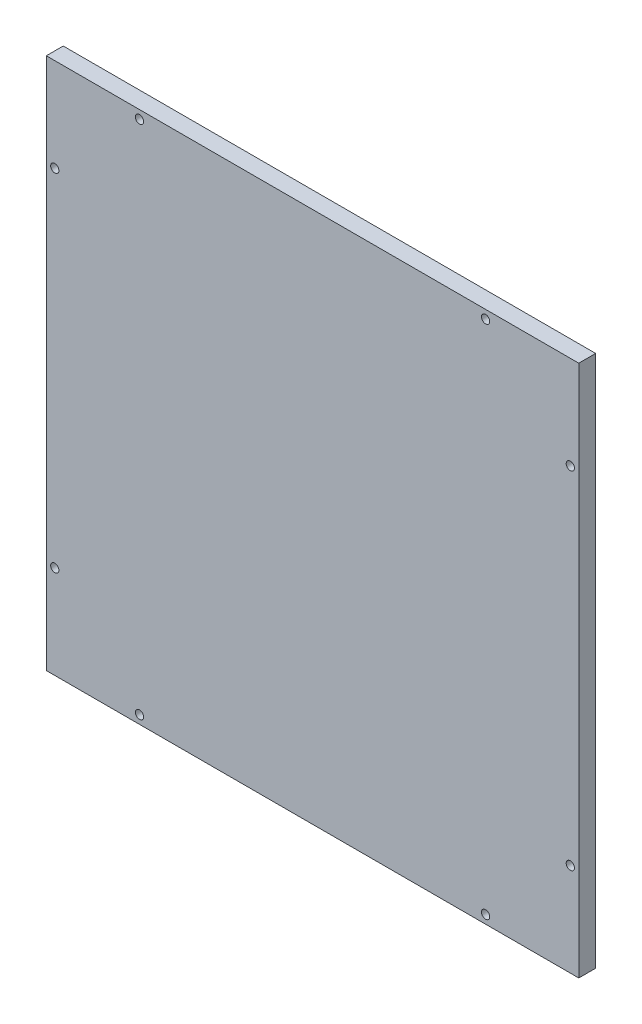
ISO-10303-21;
HEADER;
FILE_DESCRIPTION(('STEP AP214'),'2;1');
FILE_NAME('part.step','',(''),(''),'','','');
FILE_SCHEMA(('AUTOMOTIVE_DESIGN { 1 0 10303 214 1 1 1 1 }'));
ENDSEC;
DATA;
#1=APPLICATION_CONTEXT('core data for automotive mechanical design processes');
#2=APPLICATION_PROTOCOL_DEFINITION('international standard','automotive_design',2000,#1);
#3=PRODUCT_CONTEXT('',#1,'mechanical');
#4=PRODUCT('Part','Part','',(#3));
#5=PRODUCT_RELATED_PRODUCT_CATEGORY('part','',(#4));
#6=PRODUCT_DEFINITION_FORMATION('','',#4);
#7=PRODUCT_DEFINITION_CONTEXT('part definition',#1,'design');
#8=PRODUCT_DEFINITION('design','',#6,#7);
#9=PRODUCT_DEFINITION_SHAPE('','',#8);
#10=(LENGTH_UNIT() NAMED_UNIT(*) SI_UNIT(.MILLI.,.METRE.));
#11=(NAMED_UNIT(*) PLANE_ANGLE_UNIT() SI_UNIT($,.RADIAN.));
#12=(NAMED_UNIT(*) SI_UNIT($,.STERADIAN.) SOLID_ANGLE_UNIT());
#13=UNCERTAINTY_MEASURE_WITH_UNIT(LENGTH_MEASURE(1.E-05),#10,'distance_accuracy_value','');
#14=(GEOMETRIC_REPRESENTATION_CONTEXT(3) GLOBAL_UNCERTAINTY_ASSIGNED_CONTEXT((#13)) GLOBAL_UNIT_ASSIGNED_CONTEXT((#10,
#11,#12)) REPRESENTATION_CONTEXT('',''));
#15=CARTESIAN_POINT('',(0.,0.,0.));
#16=DIRECTION('',(0.,0.,1.));
#17=DIRECTION('',(1.,0.,0.));
#18=AXIS2_PLACEMENT_3D('',#15,#16,#17);
#19=CARTESIAN_POINT('',(100.,-100.,6.35));
#20=DIRECTION('',(-1.,0.,0.));
#21=DIRECTION('',(0.,0.,1.));
#22=AXIS2_PLACEMENT_3D('',#19,#20,#21);
#23=PLANE('',#22);
#24=DIRECTION('',(0.,1.,0.));
#25=VECTOR('',#24,1.);
#26=CARTESIAN_POINT('',(100.,-100.,0.));
#27=LINE('',#26,#25);
#28=CARTESIAN_POINT('',(100.,-100.,0.));
#29=VERTEX_POINT('',#28);
#30=CARTESIAN_POINT('',(100.,100.,0.));
#31=VERTEX_POINT('',#30);
#32=EDGE_CURVE('E101',#29,#31,#27,.T.);
#33=ORIENTED_EDGE('',*,*,#32,.T.);
#34=DIRECTION('',(0.,0.,-1.));
#35=VECTOR('',#34,1.);
#36=CARTESIAN_POINT('',(100.,100.,6.35));
#37=LINE('',#36,#35);
#38=CARTESIAN_POINT('',(100.,100.,6.35));
#39=VERTEX_POINT('',#38);
#40=EDGE_CURVE('E11',#39,#31,#37,.T.);
#41=ORIENTED_EDGE('',*,*,#40,.F.);
#42=DIRECTION('',(0.,1.,0.));
#43=VECTOR('',#42,1.);
#44=CARTESIAN_POINT('',(100.,-100.,6.35));
#45=LINE('',#44,#43);
#46=CARTESIAN_POINT('',(100.,-100.,6.35));
#47=VERTEX_POINT('',#46);
#48=EDGE_CURVE('E89',#47,#39,#45,.T.);
#49=ORIENTED_EDGE('',*,*,#48,.F.);
#50=DIRECTION('',(0.,0.,-1.));
#51=VECTOR('',#50,1.);
#52=CARTESIAN_POINT('',(100.,-100.,6.35));
#53=LINE('',#52,#51);
#54=EDGE_CURVE('E97',#47,#29,#53,.T.);
#55=ORIENTED_EDGE('',*,*,#54,.T.);
#56=EDGE_LOOP('',(#33,#41,#49,#55));
#57=FACE_BOUND('',#56,.T.);
#58=ADVANCED_FACE('F38',(#57),#23,.F.);
#59=CARTESIAN_POINT('',(-100.,100.,6.35));
#60=DIRECTION('',(0.,-1.,0.));
#61=DIRECTION('',(0.,0.,-1.));
#62=AXIS2_PLACEMENT_3D('',#59,#60,#61);
#63=PLANE('',#62);
#64=DIRECTION('',(-1.,0.,0.));
#65=VECTOR('',#64,1.);
#66=CARTESIAN_POINT('',(-100.,100.,0.));
#67=LINE('',#66,#65);
#68=CARTESIAN_POINT('',(-100.,100.,0.));
#69=VERTEX_POINT('',#68);
#70=EDGE_CURVE('E93',#31,#69,#67,.T.);
#71=ORIENTED_EDGE('',*,*,#70,.T.);
#72=DIRECTION('',(0.,0.,-1.));
#73=VECTOR('',#72,1.);
#74=CARTESIAN_POINT('',(-100.,100.,6.35));
#75=LINE('',#74,#73);
#76=CARTESIAN_POINT('',(-100.,100.,6.35));
#77=VERTEX_POINT('',#76);
#78=EDGE_CURVE('E46',#77,#69,#75,.T.);
#79=ORIENTED_EDGE('',*,*,#78,.F.);
#80=DIRECTION('',(-1.,0.,0.));
#81=VECTOR('',#80,1.);
#82=CARTESIAN_POINT('',(-100.,100.,6.35));
#83=LINE('',#82,#81);
#84=EDGE_CURVE('E84',#39,#77,#83,.T.);
#85=ORIENTED_EDGE('',*,*,#84,.F.);
#86=ORIENTED_EDGE('',*,*,#40,.T.);
#87=EDGE_LOOP('',(#71,#79,#85,#86));
#88=FACE_BOUND('',#87,.T.);
#89=ADVANCED_FACE('F92',(#88),#63,.F.);
#90=CARTESIAN_POINT('',(-100.,-100.,6.35));
#91=DIRECTION('',(1.,0.,0.));
#92=DIRECTION('',(0.,0.,-1.));
#93=AXIS2_PLACEMENT_3D('',#90,#91,#92);
#94=PLANE('',#93);
#95=DIRECTION('',(0.,-1.,0.));
#96=VECTOR('',#95,1.);
#97=CARTESIAN_POINT('',(-100.,-100.,0.));
#98=LINE('',#97,#96);
#99=CARTESIAN_POINT('',(-100.,-100.,0.));
#100=VERTEX_POINT('',#99);
#101=EDGE_CURVE('E71',#69,#100,#98,.T.);
#102=ORIENTED_EDGE('',*,*,#101,.T.);
#103=DIRECTION('',(0.,0.,-1.));
#104=VECTOR('',#103,1.);
#105=CARTESIAN_POINT('',(-100.,-100.,6.35));
#106=LINE('',#105,#104);
#107=CARTESIAN_POINT('',(-100.,-100.,6.35));
#108=VERTEX_POINT('',#107);
#109=EDGE_CURVE('E94',#108,#100,#106,.T.);
#110=ORIENTED_EDGE('',*,*,#109,.F.);
#111=DIRECTION('',(0.,-1.,0.));
#112=VECTOR('',#111,1.);
#113=CARTESIAN_POINT('',(-100.,-100.,6.35));
#114=LINE('',#113,#112);
#115=EDGE_CURVE('E87',#77,#108,#114,.T.);
#116=ORIENTED_EDGE('',*,*,#115,.F.);
#117=ORIENTED_EDGE('',*,*,#78,.T.);
#118=EDGE_LOOP('',(#102,#110,#116,#117));
#119=FACE_BOUND('',#118,.T.);
#120=ADVANCED_FACE('F95',(#119),#94,.F.);
#121=CARTESIAN_POINT('',(-100.,-100.,6.35));
#122=DIRECTION('',(0.,1.,0.));
#123=DIRECTION('',(0.,0.,1.));
#124=AXIS2_PLACEMENT_3D('',#121,#122,#123);
#125=PLANE('',#124);
#126=DIRECTION('',(1.,0.,0.));
#127=VECTOR('',#126,1.);
#128=CARTESIAN_POINT('',(-100.,-100.,0.));
#129=LINE('',#128,#127);
#130=EDGE_CURVE('E77',#100,#29,#129,.T.);
#131=ORIENTED_EDGE('',*,*,#130,.T.);
#132=ORIENTED_EDGE('',*,*,#54,.F.);
#133=DIRECTION('',(1.,0.,0.));
#134=VECTOR('',#133,1.);
#135=CARTESIAN_POINT('',(-100.,-100.,6.35));
#136=LINE('',#135,#134);
#137=EDGE_CURVE('E54',#108,#47,#136,.T.);
#138=ORIENTED_EDGE('',*,*,#137,.F.);
#139=ORIENTED_EDGE('',*,*,#109,.T.);
#140=EDGE_LOOP('',(#131,#132,#138,#139));
#141=FACE_BOUND('',#140,.T.);
#142=ADVANCED_FACE('F109',(#141),#125,.F.);
#143=CARTESIAN_POINT('',(0.,0.,6.35));
#144=DIRECTION('',(0.,0.,-1.));
#145=DIRECTION('',(-1.,0.,0.));
#146=AXIS2_PLACEMENT_3D('',#143,#144,#145);
#147=PLANE('',#146);
#148=CARTESIAN_POINT('',(96.825,65.,6.35));
#149=DIRECTION('',(0.,0.,1.));
#150=DIRECTION('',(1.,0.,0.));
#151=AXIS2_PLACEMENT_3D('',#148,#149,#150);
#152=CIRCLE('',#151,1.54999999999999);
#153=CARTESIAN_POINT('',(98.375,65.,6.35));
#154=VERTEX_POINT('',#153);
#155=EDGE_CURVE('E133',#154,#154,#152,.T.);
#156=ORIENTED_EDGE('',*,*,#155,.F.);
#157=EDGE_LOOP('',(#156));
#158=FACE_BOUND('',#157,.T.);
#159=CARTESIAN_POINT('',(-65.,-96.825,6.35));
#160=DIRECTION('',(0.,0.,1.));
#161=DIRECTION('',(-1.,0.,0.));
#162=AXIS2_PLACEMENT_3D('',#159,#160,#161);
#163=CIRCLE('',#162,1.54999999999998);
#164=CARTESIAN_POINT('',(-66.55,-96.825,6.35));
#165=VERTEX_POINT('',#164);
#166=EDGE_CURVE('E140',#165,#165,#163,.T.);
#167=ORIENTED_EDGE('',*,*,#166,.F.);
#168=EDGE_LOOP('',(#167));
#169=FACE_BOUND('',#168,.T.);
#170=CARTESIAN_POINT('',(65.,-96.825,6.35));
#171=DIRECTION('',(0.,0.,1.));
#172=DIRECTION('',(1.,0.,0.));
#173=AXIS2_PLACEMENT_3D('',#170,#171,#172);
#174=CIRCLE('',#173,1.54999999999999);
#175=CARTESIAN_POINT('',(66.55,-96.825,6.35));
#176=VERTEX_POINT('',#175);
#177=EDGE_CURVE('E121',#176,#176,#174,.T.);
#178=ORIENTED_EDGE('',*,*,#177,.F.);
#179=EDGE_LOOP('',(#178));
#180=FACE_BOUND('',#179,.T.);
#181=CARTESIAN_POINT('',(65.,96.825,6.35));
#182=DIRECTION('',(0.,0.,1.));
#183=DIRECTION('',(-1.,0.,0.));
#184=AXIS2_PLACEMENT_3D('',#181,#182,#183);
#185=CIRCLE('',#184,1.54999999999999);
#186=CARTESIAN_POINT('',(63.45,96.825,6.35));
#187=VERTEX_POINT('',#186);
#188=EDGE_CURVE('E128',#187,#187,#185,.T.);
#189=ORIENTED_EDGE('',*,*,#188,.F.);
#190=EDGE_LOOP('',(#189));
#191=FACE_BOUND('',#190,.T.);
#192=CARTESIAN_POINT('',(96.825,-65.,6.35));
#193=DIRECTION('',(0.,0.,1.));
#194=DIRECTION('',(-1.,0.,0.));
#195=AXIS2_PLACEMENT_3D('',#192,#193,#194);
#196=CIRCLE('',#195,1.54999999999999);
#197=CARTESIAN_POINT('',(95.275,-65.,6.35));
#198=VERTEX_POINT('',#197);
#199=EDGE_CURVE('E157',#198,#198,#196,.T.);
#200=ORIENTED_EDGE('',*,*,#199,.F.);
#201=EDGE_LOOP('',(#200));
#202=FACE_BOUND('',#201,.T.);
#203=CARTESIAN_POINT('',(-96.825,-65.,6.35));
#204=DIRECTION('',(0.,0.,1.));
#205=DIRECTION('',(1.,0.,0.));
#206=AXIS2_PLACEMENT_3D('',#203,#204,#205);
#207=CIRCLE('',#206,1.54999999999999);
#208=CARTESIAN_POINT('',(-95.275,-65.,6.35));
#209=VERTEX_POINT('',#208);
#210=EDGE_CURVE('E151',#209,#209,#207,.T.);
#211=ORIENTED_EDGE('',*,*,#210,.F.);
#212=EDGE_LOOP('',(#211));
#213=FACE_BOUND('',#212,.T.);
#214=CARTESIAN_POINT('',(-96.825,65.,6.35));
#215=DIRECTION('',(0.,0.,1.));
#216=DIRECTION('',(-1.,0.,0.));
#217=AXIS2_PLACEMENT_3D('',#214,#215,#216);
#218=CIRCLE('',#217,1.54999999999999);
#219=CARTESIAN_POINT('',(-98.375,65.,6.35));
#220=VERTEX_POINT('',#219);
#221=EDGE_CURVE('E145',#220,#220,#218,.T.);
#222=ORIENTED_EDGE('',*,*,#221,.F.);
#223=EDGE_LOOP('',(#222));
#224=FACE_BOUND('',#223,.T.);
#225=CARTESIAN_POINT('',(-65.,96.825,6.35));
#226=DIRECTION('',(0.,0.,1.));
#227=DIRECTION('',(1.,0.,0.));
#228=AXIS2_PLACEMENT_3D('',#225,#226,#227);
#229=CIRCLE('',#228,1.54999999999999);
#230=CARTESIAN_POINT('',(-63.45,96.825,6.35));
#231=VERTEX_POINT('',#230);
#232=EDGE_CURVE('E115',#231,#231,#229,.T.);
#233=ORIENTED_EDGE('',*,*,#232,.F.);
#234=EDGE_LOOP('',(#233));
#235=FACE_BOUND('',#234,.T.);
#236=ORIENTED_EDGE('',*,*,#48,.T.);
#237=ORIENTED_EDGE('',*,*,#84,.T.);
#238=ORIENTED_EDGE('',*,*,#115,.T.);
#239=ORIENTED_EDGE('',*,*,#137,.T.);
#240=EDGE_LOOP('',(#236,#237,#238,#239));
#241=FACE_BOUND('',#240,.T.);
#242=ADVANCED_FACE('F85',(#158,#169,#180,#191,#202,#213,#224,#235,#241),#147,.F.);
#243=CARTESIAN_POINT('',(0.,0.,0.));
#244=DIRECTION('',(0.,0.,-1.));
#245=DIRECTION('',(-1.,0.,0.));
#246=AXIS2_PLACEMENT_3D('',#243,#244,#245);
#247=PLANE('',#246);
#248=CARTESIAN_POINT('',(96.825,65.,0.));
#249=DIRECTION('',(0.,0.,1.));
#250=DIRECTION('',(1.,0.,0.));
#251=AXIS2_PLACEMENT_3D('',#248,#249,#250);
#252=CIRCLE('',#251,1.54999999999999);
#253=CARTESIAN_POINT('',(98.375,65.,0.));
#254=VERTEX_POINT('',#253);
#255=EDGE_CURVE('E136',#254,#254,#252,.T.);
#256=ORIENTED_EDGE('',*,*,#255,.T.);
#257=EDGE_LOOP('',(#256));
#258=FACE_BOUND('',#257,.T.);
#259=CARTESIAN_POINT('',(-65.,-96.825,0.));
#260=DIRECTION('',(0.,0.,1.));
#261=DIRECTION('',(-1.,0.,0.));
#262=AXIS2_PLACEMENT_3D('',#259,#260,#261);
#263=CIRCLE('',#262,1.54999999999998);
#264=CARTESIAN_POINT('',(-66.55,-96.825,0.));
#265=VERTEX_POINT('',#264);
#266=EDGE_CURVE('E125',#265,#265,#263,.T.);
#267=ORIENTED_EDGE('',*,*,#266,.T.);
#268=EDGE_LOOP('',(#267));
#269=FACE_BOUND('',#268,.T.);
#270=CARTESIAN_POINT('',(65.,-96.825,0.));
#271=DIRECTION('',(0.,0.,1.));
#272=DIRECTION('',(1.,0.,0.));
#273=AXIS2_PLACEMENT_3D('',#270,#271,#272);
#274=CIRCLE('',#273,1.54999999999999);
#275=CARTESIAN_POINT('',(66.55,-96.825,0.));
#276=VERTEX_POINT('',#275);
#277=EDGE_CURVE('E124',#276,#276,#274,.T.);
#278=ORIENTED_EDGE('',*,*,#277,.T.);
#279=EDGE_LOOP('',(#278));
#280=FACE_BOUND('',#279,.T.);
#281=CARTESIAN_POINT('',(65.,96.825,0.));
#282=DIRECTION('',(0.,0.,1.));
#283=DIRECTION('',(-1.,0.,0.));
#284=AXIS2_PLACEMENT_3D('',#281,#282,#283);
#285=CIRCLE('',#284,1.54999999999999);
#286=CARTESIAN_POINT('',(63.45,96.825,0.));
#287=VERTEX_POINT('',#286);
#288=EDGE_CURVE('E118',#287,#287,#285,.T.);
#289=ORIENTED_EDGE('',*,*,#288,.T.);
#290=EDGE_LOOP('',(#289));
#291=FACE_BOUND('',#290,.T.);
#292=CARTESIAN_POINT('',(96.825,-65.,0.));
#293=DIRECTION('',(0.,0.,1.));
#294=DIRECTION('',(-1.,0.,0.));
#295=AXIS2_PLACEMENT_3D('',#292,#293,#294);
#296=CIRCLE('',#295,1.54999999999999);
#297=CARTESIAN_POINT('',(95.275,-65.,0.));
#298=VERTEX_POINT('',#297);
#299=EDGE_CURVE('E137',#298,#298,#296,.T.);
#300=ORIENTED_EDGE('',*,*,#299,.T.);
#301=EDGE_LOOP('',(#300));
#302=FACE_BOUND('',#301,.T.);
#303=CARTESIAN_POINT('',(-96.825,-65.,0.));
#304=DIRECTION('',(0.,0.,1.));
#305=DIRECTION('',(1.,0.,0.));
#306=AXIS2_PLACEMENT_3D('',#303,#304,#305);
#307=CIRCLE('',#306,1.54999999999999);
#308=CARTESIAN_POINT('',(-95.275,-65.,0.));
#309=VERTEX_POINT('',#308);
#310=EDGE_CURVE('E154',#309,#309,#307,.T.);
#311=ORIENTED_EDGE('',*,*,#310,.T.);
#312=EDGE_LOOP('',(#311));
#313=FACE_BOUND('',#312,.T.);
#314=CARTESIAN_POINT('',(-96.825,65.,0.));
#315=DIRECTION('',(0.,0.,1.));
#316=DIRECTION('',(-1.,0.,0.));
#317=AXIS2_PLACEMENT_3D('',#314,#315,#316);
#318=CIRCLE('',#317,1.54999999999999);
#319=CARTESIAN_POINT('',(-98.375,65.,0.));
#320=VERTEX_POINT('',#319);
#321=EDGE_CURVE('E148',#320,#320,#318,.T.);
#322=ORIENTED_EDGE('',*,*,#321,.T.);
#323=EDGE_LOOP('',(#322));
#324=FACE_BOUND('',#323,.T.);
#325=CARTESIAN_POINT('',(-65.,96.825,0.));
#326=DIRECTION('',(0.,0.,1.));
#327=DIRECTION('',(1.,0.,0.));
#328=AXIS2_PLACEMENT_3D('',#325,#326,#327);
#329=CIRCLE('',#328,1.54999999999999);
#330=CARTESIAN_POINT('',(-63.45,96.825,0.));
#331=VERTEX_POINT('',#330);
#332=EDGE_CURVE('E104',#331,#331,#329,.T.);
#333=ORIENTED_EDGE('',*,*,#332,.T.);
#334=EDGE_LOOP('',(#333));
#335=FACE_BOUND('',#334,.T.);
#336=ORIENTED_EDGE('',*,*,#32,.F.);
#337=ORIENTED_EDGE('',*,*,#130,.F.);
#338=ORIENTED_EDGE('',*,*,#101,.F.);
#339=ORIENTED_EDGE('',*,*,#70,.F.);
#340=EDGE_LOOP('',(#336,#337,#338,#339));
#341=FACE_BOUND('',#340,.T.);
#342=ADVANCED_FACE('F112',(#258,#269,#280,#291,#302,#313,#324,#335,#341),#247,.T.);
#343=CARTESIAN_POINT('',(-65.,96.825,0.));
#344=DIRECTION('',(0.,0.,1.));
#345=DIRECTION('',(1.,0.,0.));
#346=AXIS2_PLACEMENT_3D('',#343,#344,#345);
#347=CYLINDRICAL_SURFACE('',#346,1.54999999999999);
#348=ORIENTED_EDGE('',*,*,#332,.F.);
#349=EDGE_LOOP('',(#348));
#350=FACE_BOUND('',#349,.T.);
#351=ORIENTED_EDGE('',*,*,#232,.T.);
#352=EDGE_LOOP('',(#351));
#353=FACE_BOUND('',#352,.T.);
#354=ADVANCED_FACE('F183',(#350,#353),#347,.F.);
#355=CARTESIAN_POINT('',(-96.825,65.,0.));
#356=DIRECTION('',(0.,0.,1.));
#357=DIRECTION('',(1.,0.,0.));
#358=AXIS2_PLACEMENT_3D('',#355,#356,#357);
#359=CYLINDRICAL_SURFACE('',#358,1.54999999999999);
#360=ORIENTED_EDGE('',*,*,#321,.F.);
#361=EDGE_LOOP('',(#360));
#362=FACE_BOUND('',#361,.T.);
#363=ORIENTED_EDGE('',*,*,#221,.T.);
#364=EDGE_LOOP('',(#363));
#365=FACE_BOUND('',#364,.T.);
#366=ADVANCED_FACE('F185',(#362,#365),#359,.F.);
#367=CARTESIAN_POINT('',(-96.825,-65.,0.));
#368=DIRECTION('',(0.,0.,1.));
#369=DIRECTION('',(1.,0.,0.));
#370=AXIS2_PLACEMENT_3D('',#367,#368,#369);
#371=CYLINDRICAL_SURFACE('',#370,1.54999999999999);
#372=ORIENTED_EDGE('',*,*,#310,.F.);
#373=EDGE_LOOP('',(#372));
#374=FACE_BOUND('',#373,.T.);
#375=ORIENTED_EDGE('',*,*,#210,.T.);
#376=EDGE_LOOP('',(#375));
#377=FACE_BOUND('',#376,.T.);
#378=ADVANCED_FACE('F169',(#374,#377),#371,.F.);
#379=CARTESIAN_POINT('',(96.825,-65.,0.));
#380=DIRECTION('',(0.,0.,1.));
#381=DIRECTION('',(1.,0.,0.));
#382=AXIS2_PLACEMENT_3D('',#379,#380,#381);
#383=CYLINDRICAL_SURFACE('',#382,1.54999999999999);
#384=ORIENTED_EDGE('',*,*,#299,.F.);
#385=EDGE_LOOP('',(#384));
#386=FACE_BOUND('',#385,.T.);
#387=ORIENTED_EDGE('',*,*,#199,.T.);
#388=EDGE_LOOP('',(#387));
#389=FACE_BOUND('',#388,.T.);
#390=ADVANCED_FACE('F165',(#386,#389),#383,.F.);
#391=CARTESIAN_POINT('',(65.,96.825,0.));
#392=DIRECTION('',(0.,0.,1.));
#393=DIRECTION('',(1.,0.,0.));
#394=AXIS2_PLACEMENT_3D('',#391,#392,#393);
#395=CYLINDRICAL_SURFACE('',#394,1.54999999999999);
#396=ORIENTED_EDGE('',*,*,#288,.F.);
#397=EDGE_LOOP('',(#396));
#398=FACE_BOUND('',#397,.T.);
#399=ORIENTED_EDGE('',*,*,#188,.T.);
#400=EDGE_LOOP('',(#399));
#401=FACE_BOUND('',#400,.T.);
#402=ADVANCED_FACE('F168',(#398,#401),#395,.F.);
#403=CARTESIAN_POINT('',(65.,-96.825,0.));
#404=DIRECTION('',(0.,0.,1.));
#405=DIRECTION('',(1.,0.,0.));
#406=AXIS2_PLACEMENT_3D('',#403,#404,#405);
#407=CYLINDRICAL_SURFACE('',#406,1.54999999999999);
#408=ORIENTED_EDGE('',*,*,#277,.F.);
#409=EDGE_LOOP('',(#408));
#410=FACE_BOUND('',#409,.T.);
#411=ORIENTED_EDGE('',*,*,#177,.T.);
#412=EDGE_LOOP('',(#411));
#413=FACE_BOUND('',#412,.T.);
#414=ADVANCED_FACE('F254',(#410,#413),#407,.F.);
#415=CARTESIAN_POINT('',(-65.,-96.825,0.));
#416=DIRECTION('',(0.,0.,1.));
#417=DIRECTION('',(1.,0.,0.));
#418=AXIS2_PLACEMENT_3D('',#415,#416,#417);
#419=CYLINDRICAL_SURFACE('',#418,1.54999999999998);
#420=ORIENTED_EDGE('',*,*,#266,.F.);
#421=EDGE_LOOP('',(#420));
#422=FACE_BOUND('',#421,.T.);
#423=ORIENTED_EDGE('',*,*,#166,.T.);
#424=EDGE_LOOP('',(#423));
#425=FACE_BOUND('',#424,.T.);
#426=ADVANCED_FACE('F264',(#422,#425),#419,.F.);
#427=CARTESIAN_POINT('',(96.825,65.,0.));
#428=DIRECTION('',(0.,0.,1.));
#429=DIRECTION('',(1.,0.,0.));
#430=AXIS2_PLACEMENT_3D('',#427,#428,#429);
#431=CYLINDRICAL_SURFACE('',#430,1.54999999999999);
#432=ORIENTED_EDGE('',*,*,#255,.F.);
#433=EDGE_LOOP('',(#432));
#434=FACE_BOUND('',#433,.T.);
#435=ORIENTED_EDGE('',*,*,#155,.T.);
#436=EDGE_LOOP('',(#435));
#437=FACE_BOUND('',#436,.T.);
#438=ADVANCED_FACE('F273',(#434,#437),#431,.F.);
#439=CLOSED_SHELL('',(#58,#89,#120,#142,#242,#342,#354,#366,#378,#390,#402,#414,#426,#438));
#440=MANIFOLD_SOLID_BREP('B2',#439);
#441=ADVANCED_BREP_SHAPE_REPRESENTATION('',(#18,#440),#14);
#442=SHAPE_DEFINITION_REPRESENTATION(#9,#441);
ENDSEC;
END-ISO-10303-21;
